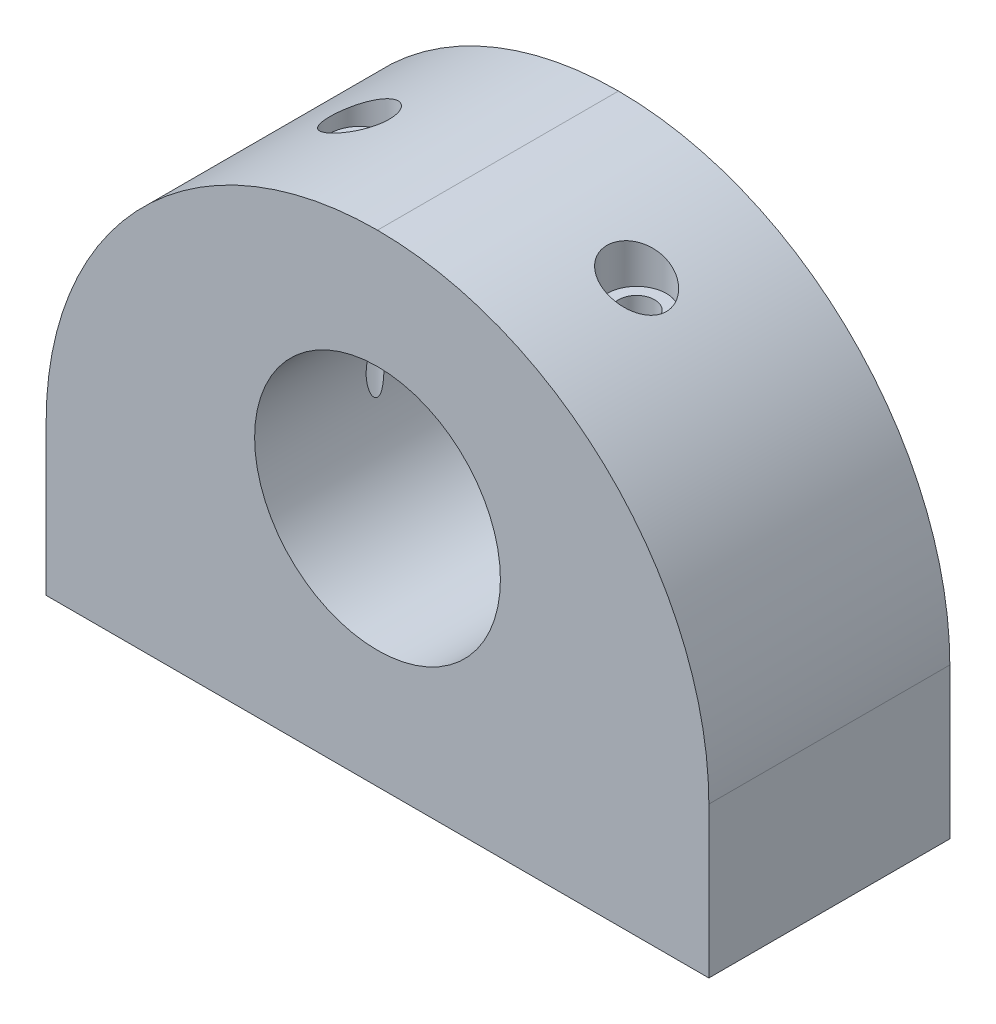
ISO-10303-21;
HEADER;
FILE_DESCRIPTION(('STEP AP214'),'2;1');
FILE_NAME('part.step','',(''),(''),'','','');
FILE_SCHEMA(('AUTOMOTIVE_DESIGN { 1 0 10303 214 1 1 1 1 }'));
ENDSEC;
DATA;
#1=APPLICATION_CONTEXT('core data for automotive mechanical design processes');
#2=APPLICATION_PROTOCOL_DEFINITION('international standard','automotive_design',2000,#1);
#3=PRODUCT_CONTEXT('',#1,'mechanical');
#4=PRODUCT('Part','Part','',(#3));
#5=PRODUCT_RELATED_PRODUCT_CATEGORY('part','',(#4));
#6=PRODUCT_DEFINITION_FORMATION('','',#4);
#7=PRODUCT_DEFINITION_CONTEXT('part definition',#1,'design');
#8=PRODUCT_DEFINITION('design','',#6,#7);
#9=PRODUCT_DEFINITION_SHAPE('','',#8);
#10=(LENGTH_UNIT() NAMED_UNIT(*) SI_UNIT(.MILLI.,.METRE.));
#11=(NAMED_UNIT(*) PLANE_ANGLE_UNIT() SI_UNIT($,.RADIAN.));
#12=(NAMED_UNIT(*) SI_UNIT($,.STERADIAN.) SOLID_ANGLE_UNIT());
#13=UNCERTAINTY_MEASURE_WITH_UNIT(LENGTH_MEASURE(1.E-05),#10,'distance_accuracy_value','');
#14=(GEOMETRIC_REPRESENTATION_CONTEXT(3) GLOBAL_UNCERTAINTY_ASSIGNED_CONTEXT((#13)) GLOBAL_UNIT_ASSIGNED_CONTEXT((#10,
#11,#12)) REPRESENTATION_CONTEXT('',''));
#15=CARTESIAN_POINT('',(0.,0.,0.));
#16=DIRECTION('',(0.,0.,1.));
#17=DIRECTION('',(1.,0.,0.));
#18=AXIS2_PLACEMENT_3D('',#15,#16,#17);
#19=CARTESIAN_POINT('',(0.,12.5,10.));
#20=DIRECTION('',(0.,0.,1.));
#21=DIRECTION('',(1.,0.,0.));
#22=AXIS2_PLACEMENT_3D('',#19,#20,#21);
#23=CYLINDRICAL_SURFACE('',#22,27.5);
#24=DIRECTION('',(0.,0.,-1.));
#25=VECTOR('',#24,1.);
#26=CARTESIAN_POINT('',(-27.5,12.5,-10.));
#27=LINE('',#26,#25);
#28=CARTESIAN_POINT('',(-27.5,12.5,10.));
#29=VERTEX_POINT('',#28);
#30=CARTESIAN_POINT('',(-27.5,12.5,-10.));
#31=VERTEX_POINT('',#30);
#32=EDGE_CURVE('E12',#29,#31,#27,.T.);
#33=ORIENTED_EDGE('',*,*,#32,.F.);
#34=CARTESIAN_POINT('',(0.,12.5,10.));
#35=DIRECTION('',(0.,0.,-1.));
#36=DIRECTION('',(-1.,0.,0.));
#37=AXIS2_PLACEMENT_3D('',#34,#35,#36);
#38=CIRCLE('',#37,27.5);
#39=CARTESIAN_POINT('',(0.,40.,10.));
#40=VERTEX_POINT('',#39);
#41=EDGE_CURVE('E90',#40,#29,#38,.F.);
#42=ORIENTED_EDGE('',*,*,#41,.F.);
#43=DIRECTION('',(0.,0.,-1.));
#44=VECTOR('',#43,1.);
#45=CARTESIAN_POINT('',(0.,40.,10.));
#46=LINE('',#45,#44);
#47=CARTESIAN_POINT('',(0.,40.,-10.));
#48=VERTEX_POINT('',#47);
#49=EDGE_CURVE('E141',#48,#40,#46,.F.);
#50=ORIENTED_EDGE('',*,*,#49,.F.);
#51=CARTESIAN_POINT('',(0.,12.5,-10.));
#52=DIRECTION('',(0.,0.,-1.));
#53=DIRECTION('',(-1.,0.,0.));
#54=AXIS2_PLACEMENT_3D('',#51,#52,#53);
#55=CIRCLE('',#54,27.5);
#56=EDGE_CURVE('E153',#31,#48,#55,.T.);
#57=ORIENTED_EDGE('',*,*,#56,.F.);
#58=EDGE_LOOP('',(#33,#42,#50,#57));
#59=FACE_BOUND('',#58,.T.);
#60=CARTESIAN_POINT('',(-11.4636628442395,37.4966884645467,-2.43388740714656));
#61=CARTESIAN_POINT('',(-11.3187502849007,37.5631445263369,-2.43388292746166));
#62=CARTESIAN_POINT('',(-11.17316637208,37.6283723018546,-2.42108412599054));
#63=CARTESIAN_POINT('',(-10.8846904437393,37.7546700116435,-2.36939334544817));
#64=CARTESIAN_POINT('',(-10.7418008597957,37.8157363090562,-2.33047885711886));
#65=CARTESIAN_POINT('',(-10.4628652074215,37.9322896340026,-2.2264448284835));
#66=CARTESIAN_POINT('',(-10.3268394170802,37.9877605639262,-2.16125223275013));
#67=CARTESIAN_POINT('',(-10.0670593459489,38.0914807503173,-2.00556820236093));
#68=CARTESIAN_POINT('',(-9.94329890143685,38.1397336403512,-1.91508956296168));
#69=CARTESIAN_POINT('',(-9.72040849568458,38.2250272940972,-1.71735432002899));
#70=CARTESIAN_POINT('',(-9.6202164219388,38.2625838138848,-1.61151883352352));
#71=CARTESIAN_POINT('',(-9.43913016097397,38.3294825129698,-1.38219586834433));
#72=CARTESIAN_POINT('',(-9.35822786411754,38.3588281451194,-1.25871584267422));
#73=CARTESIAN_POINT('',(-9.2241982598767,38.4069275520465,-1.00716879322838));
#74=CARTESIAN_POINT('',(-9.16950779606019,38.4262850073808,-0.880048498421058));
#75=CARTESIAN_POINT('',(-9.08202884804133,38.457059238826,-0.617579103269964));
#76=CARTESIAN_POINT('',(-9.04923380174365,38.4684783941019,-0.482232481650487));
#77=CARTESIAN_POINT('',(-9.00783569194936,38.482866557803,-0.213633650055177));
#78=CARTESIAN_POINT('',(-8.99822423227221,38.4861878651252,-0.0805547632115815));
#79=CARTESIAN_POINT('',(-9.0005960185081,38.485366562536,0.185378765012726));
#80=CARTESIAN_POINT('',(-9.01257648877072,38.4812249119907,0.318233433019376));
#81=CARTESIAN_POINT('',(-9.05733704534923,38.4656539679864,0.577943304712344));
#82=CARTESIAN_POINT('',(-9.08981317367476,38.4543311617179,0.704857552161629));
#83=CARTESIAN_POINT('',(-9.17408132843954,38.4246641798452,0.951218226379017));
#84=CARTESIAN_POINT('',(-9.22587362922108,38.4063199045169,1.07066454705407));
#85=CARTESIAN_POINT('',(-9.34772966522737,38.3626018618709,1.30049902811941));
#86=CARTESIAN_POINT('',(-9.41802560376285,38.3371384842706,1.41074677619876));
#87=CARTESIAN_POINT('',(-9.57410919294028,38.2797077568492,1.6177314500106));
#88=CARTESIAN_POINT('',(-9.65989899480498,38.2477395037899,1.71446649628001));
#89=CARTESIAN_POINT('',(-9.84785633347399,38.1764522289789,1.89591831838503));
#90=CARTESIAN_POINT('',(-9.95053837575958,38.1368920070729,1.98000648969695));
#91=CARTESIAN_POINT('',(-10.1663755991783,38.0520694214483,2.12983045385975));
#92=CARTESIAN_POINT('',(-10.2795334087527,38.0068056256299,2.19556162410659));
#93=CARTESIAN_POINT('',(-10.5204690601516,37.9084176101991,2.31133515906335));
#94=CARTESIAN_POINT('',(-10.6487188812109,37.854977585868,2.3601254560184));
#95=CARTESIAN_POINT('',(-10.9097486847534,37.7437622820573,2.43559952966823));
#96=CARTESIAN_POINT('',(-11.0425301819699,37.6859855451174,2.46227583780033));
#97=CARTESIAN_POINT('',(-11.3193211836281,37.5628723462289,2.4948153758474));
#98=CARTESIAN_POINT('',(-11.4634250093645,37.4972940119841,2.49896505170834));
#99=CARTESIAN_POINT('',(-11.7493036814876,37.3642064342504,2.48239173889646));
#100=CARTESIAN_POINT('',(-11.8910776632438,37.2966964983103,2.46165971862359));
#101=CARTESIAN_POINT('',(-12.1772143432655,37.1574984977397,2.39409289184429));
#102=CARTESIAN_POINT('',(-12.3212241685044,37.0858021861073,2.34577014522717));
#103=CARTESIAN_POINT('',(-12.598931527091,36.9446561038351,2.22300706106538));
#104=CARTESIAN_POINT('',(-12.7326258980716,36.8752070258794,2.14855875281559));
#105=CARTESIAN_POINT('',(-12.9858663442058,36.7412424213846,1.9745690047809));
#106=CARTESIAN_POINT('',(-13.1053887872863,36.6767351971755,1.87498649447732));
#107=CARTESIAN_POINT('',(-13.3255203462404,36.5561067506252,1.65249352076747));
#108=CARTESIAN_POINT('',(-13.4261392446099,36.4999811939118,1.52959518973868));
#109=CARTESIAN_POINT('',(-13.5957519082172,36.4042719347363,1.27483897594976));
#110=CARTESIAN_POINT('',(-13.666750258423,36.3636668186367,1.14472294323275));
#111=CARTESIAN_POINT('',(-13.755393969547,36.3126079347279,0.939616906211138));
#112=CARTESIAN_POINT('',(-13.7819663236981,36.2972297207655,0.869592529792016));
#113=CARTESIAN_POINT('',(-13.828782310287,36.270054833589,0.726795207073282));
#114=CARTESIAN_POINT('',(-13.8490270301533,36.258257544989,0.654022735456443));
#115=CARTESIAN_POINT('',(-13.8949916442726,36.231422090962,0.453089483054786));
#116=CARTESIAN_POINT('',(-13.9141367089608,36.220179035691,0.322820492593811));
#117=CARTESIAN_POINT('',(-13.9313329630078,36.2100836532432,0.0605224696961118));
#118=CARTESIAN_POINT('',(-13.9293957867765,36.2112244919107,-0.0715055518270032));
#119=CARTESIAN_POINT('',(-13.9056695241169,36.2251449443268,-0.321777287296414));
#120=CARTESIAN_POINT('',(-13.8855743050843,36.236931441135,-0.440241982742023));
#121=CARTESIAN_POINT('',(-13.8288590228901,36.2700173700091,-0.671731435753916));
#122=CARTESIAN_POINT('',(-13.7922379449076,36.2913173862809,-0.784755858771852));
#123=CARTESIAN_POINT('',(-13.7028767840055,36.3429000094931,-1.00564352557963));
#124=CARTESIAN_POINT('',(-13.6497365809356,36.3734049679851,-1.11329166082722));
#125=CARTESIAN_POINT('',(-13.5297074692939,36.4416326365473,-1.31808684204922));
#126=CARTESIAN_POINT('',(-13.46281418096,36.4793576456258,-1.41523052773618));
#127=CARTESIAN_POINT('',(-13.3095007104101,36.5648223428198,-1.60739759469621));
#128=CARTESIAN_POINT('',(-13.2217560258734,36.6132020547928,-1.70107755743184));
#129=CARTESIAN_POINT('',(-13.0344675746565,36.7149545648423,-1.87262582386961));
#130=CARTESIAN_POINT('',(-12.9349152640853,36.7683309725245,-1.95048256612987));
#131=CARTESIAN_POINT('',(-12.7131446098331,36.8853147538789,-2.09832984687759));
#132=CARTESIAN_POINT('',(-12.5896533267602,36.9493605933034,-2.16606596807872));
#133=CARTESIAN_POINT('',(-12.3339282432006,37.0793563158435,-2.27934293762099));
#134=CARTESIAN_POINT('',(-12.2016995614947,37.1453050716041,-2.32489665280735));
#135=CARTESIAN_POINT('',(-11.9683746295409,37.2592408680313,-2.38377935751793));
#136=CARTESIAN_POINT('',(-11.86860625623,37.307228593442,-2.40250560759982));
#137=CARTESIAN_POINT('',(-11.6672236970172,37.4025763590298,-2.42756157229922));
#138=CARTESIAN_POINT('',(-11.5656094030279,37.4499363621681,-2.43389055862261));
#139=CARTESIAN_POINT('',(-11.4636628442395,37.4966884645467,-2.43388740714656));
#140=B_SPLINE_CURVE_WITH_KNOTS('',3,(#60,#61,#62,#63,#64,#65,#66,#67,#68,#69,#70,#71,#72,#73,
#74,#75,#76,#77,#78,#79,#80,#81,#82,#83,#84,#85,#86,#87,#88,#89,#90,#91,#92,#93,#94,#95,#96,#97,
#98,#99,#100,#101,#102,#103,#104,#105,#106,#107,#108,#109,#110,#111,#112,#113,#114,#115,#116,
#117,#118,#119,#120,#121,#122,#123,#124,#125,#126,#127,#128,#129,#130,#131,#132,#133,#134,#135,
#136,#137,#138,#139),.UNSPECIFIED.,.T.,.F.,(4,2,2,2,2,2,2,2,2,2,2,2,2,2,2,2,2,2,2,2,2,2,2,2,2,2,
2,2,2,2,2,2,2,2,2,2,2,2,2,4),(0.,0.477893257210122,0.956198943228954,1.43584363432737,
1.91524605347493,2.36436117797892,2.81328715523456,3.23036802712489,3.64732384296207,
4.0457879219178,4.44420078182535,4.83683958183017,5.22948395858852,5.62731227863222,
6.02519587709018,6.43885557554874,6.85261934679835,7.29249830949078,7.73252577215443,
8.20559995740199,8.67884591186331,9.18041465334582,9.68213655277133,10.1846836590558,
10.6869699788627,11.1450274437512,11.3740584123676,11.6030499994571,11.9971290226849,
12.3909905811594,12.7515210856969,13.1120737327268,13.4821475583303,13.8523394194736,
14.2622120119965,14.6723830150313,15.134640660577,15.5966298544698,15.9328099027657,
16.2690096998233),.UNSPECIFIED.);
#141=CARTESIAN_POINT('',(-11.4636628442395,37.4966884645467,-2.43388740714656));
#142=VERTEX_POINT('',#141);
#143=EDGE_CURVE('E73',#142,#142,#140,.T.);
#144=ORIENTED_EDGE('',*,*,#143,.T.);
#145=EDGE_LOOP('',(#144));
#146=FACE_BOUND('',#145,.T.);
#147=ADVANCED_FACE('F69',(#59,#146),#23,.T.);
#148=CARTESIAN_POINT('',(0.,12.5,0.));
#149=DIRECTION('',(0.,0.,-1.));
#150=DIRECTION('',(-1.,0.,0.));
#151=AXIS2_PLACEMENT_3D('',#148,#149,#150);
#152=CYLINDRICAL_SURFACE('',#151,27.5);
#153=CARTESIAN_POINT('',(0.,12.5,10.));
#154=DIRECTION('',(0.,0.,-1.));
#155=DIRECTION('',(-1.,0.,0.));
#156=AXIS2_PLACEMENT_3D('',#153,#154,#155);
#157=CIRCLE('',#156,27.5);
#158=CARTESIAN_POINT('',(27.5,12.5,10.));
#159=VERTEX_POINT('',#158);
#160=EDGE_CURVE('E82',#159,#40,#157,.F.);
#161=ORIENTED_EDGE('',*,*,#160,.F.);
#162=DIRECTION('',(0.,0.,-1.));
#163=VECTOR('',#162,1.);
#164=CARTESIAN_POINT('',(27.5,12.5,10.));
#165=LINE('',#164,#163);
#166=CARTESIAN_POINT('',(27.5,12.5,-10.));
#167=VERTEX_POINT('',#166);
#168=EDGE_CURVE('E160',#167,#159,#165,.F.);
#169=ORIENTED_EDGE('',*,*,#168,.F.);
#170=CARTESIAN_POINT('',(0.,12.5,-10.));
#171=DIRECTION('',(0.,0.,-1.));
#172=DIRECTION('',(-1.,0.,0.));
#173=AXIS2_PLACEMENT_3D('',#170,#171,#172);
#174=CIRCLE('',#173,27.5);
#175=EDGE_CURVE('E158',#48,#167,#174,.T.);
#176=ORIENTED_EDGE('',*,*,#175,.F.);
#177=ORIENTED_EDGE('',*,*,#49,.T.);
#178=EDGE_LOOP('',(#161,#169,#176,#177));
#179=FACE_BOUND('',#178,.T.);
#180=CARTESIAN_POINT('',(11.5363371557605,37.4632314620647,-2.4360841246819));
#181=CARTESIAN_POINT('',(11.6897433726353,37.3923347267846,-2.43607902730868));
#182=CARTESIAN_POINT('',(11.8426296421748,37.3199486584,-2.42174371684128));
#183=CARTESIAN_POINT('',(12.1430116175024,37.1743844893178,-2.36520718517411));
#184=CARTESIAN_POINT('',(12.2904968442241,37.1012051725748,-2.32295453922795));
#185=CARTESIAN_POINT('',(12.5759060812687,36.9565363729112,-2.21154725469069));
#186=CARTESIAN_POINT('',(12.7138288929735,36.88504710257,-2.14238925075607));
#187=CARTESIAN_POINT('',(12.9759670752474,36.7465720677406,-1.97832238174008));
#188=CARTESIAN_POINT('',(13.1001868042679,36.6795848739702,-1.88342173786636));
#189=CARTESIAN_POINT('',(13.3270409855903,36.5552743613435,-1.67261414241162));
#190=CARTESIAN_POINT('',(13.4302132740268,36.4977205860578,-1.55742671926553));
#191=CARTESIAN_POINT('',(13.6148926492006,36.3934293851152,-1.30657574187727));
#192=CARTESIAN_POINT('',(13.6964203550865,36.3466816708761,-1.17093186954491));
#193=CARTESIAN_POINT('',(13.8249315889303,36.2723823534441,-0.900056341512269));
#194=CARTESIAN_POINT('',(13.8748700307092,36.2432091160916,-0.766693688650086));
#195=CARTESIAN_POINT('',(13.9321581287729,36.2096065230187,-0.560314684845361));
#196=CARTESIAN_POINT('',(13.9483180058318,36.200098271567,-0.490461488797693));
#197=CARTESIAN_POINT('',(13.9745411335176,36.1846454492442,-0.349238379335035));
#198=CARTESIAN_POINT('',(13.9846051822937,36.1787004118295,-0.277868665750409));
#199=CARTESIAN_POINT('',(14.0035080972494,36.1675306173733,-0.081503287251604));
#200=CARTESIAN_POINT('',(14.0060227080411,36.1660391859402,0.0443936777576234));
#201=CARTESIAN_POINT('',(13.9919008692107,36.174390422627,0.294632582818073));
#202=CARTESIAN_POINT('',(13.9752690399399,36.1842303563022,0.418974890715409));
#203=CARTESIAN_POINT('',(13.924911010719,36.213870413569,0.657154176422131));
#204=CARTESIAN_POINT('',(13.8919575755661,36.2332199979547,0.771212886388198));
#205=CARTESIAN_POINT('',(13.8108469813195,36.2805108563567,0.991863031813362));
#206=CARTESIAN_POINT('',(13.7626869864523,36.3084537328554,1.09845306995398));
#207=CARTESIAN_POINT('',(13.649397388221,36.3735936739583,1.3087460017926));
#208=CARTESIAN_POINT('',(13.5833696318309,36.4112734694948,1.41181306712599));
#209=CARTESIAN_POINT('',(13.4383707290971,36.4930639945168,1.60551244505964));
#210=CARTESIAN_POINT('',(13.3593938513319,36.5371775707037,1.69613921867113));
#211=CARTESIAN_POINT('',(13.1801738137447,36.6359631224589,1.87424361435776));
#212=CARTESIAN_POINT('',(13.0785081275035,36.6912660814918,1.95993945256468));
#213=CARTESIAN_POINT('',(12.8643184998488,36.8058446221563,2.11317381550108));
#214=CARTESIAN_POINT('',(12.7517889818945,36.8651222392096,2.18070294696669));
#215=CARTESIAN_POINT('',(12.5046122021861,36.9929828218023,2.30368239328101));
#216=CARTESIAN_POINT('',(12.3689224469686,37.0618378687411,2.35676373809518));
#217=CARTESIAN_POINT('',(12.0905529761738,37.2000547262615,2.43831517730562));
#218=CARTESIAN_POINT('',(11.9478705724763,37.2694167228674,2.46677572728223));
#219=CARTESIAN_POINT('',(11.6509477270446,37.4105173503326,2.49911282120013));
#220=CARTESIAN_POINT('',(11.4965058607596,37.4821735509847,2.50153374238884));
#221=CARTESIAN_POINT('',(11.188190918811,37.6217637396061,2.4772062658126));
#222=CARTESIAN_POINT('',(11.0343178197578,37.6896978822626,2.45045908122965));
#223=CARTESIAN_POINT('',(10.7358729781339,37.8183094854816,2.368509881174));
#224=CARTESIAN_POINT('',(10.5911656451032,37.8791241128072,2.31402224343336));
#225=CARTESIAN_POINT('',(10.3123172761061,37.9937016567376,2.1774827042363));
#226=CARTESIAN_POINT('',(10.1781713405997,38.0474678509741,2.09544367827467));
#227=CARTESIAN_POINT('',(9.93534662555918,38.1428289482943,1.9125000729195));
#228=CARTESIAN_POINT('',(9.82551826996986,38.1850297954634,1.8134385279726));
#229=CARTESIAN_POINT('',(9.62415057394914,38.2611593917952,1.59550960882426));
#230=CARTESIAN_POINT('',(9.53260201128487,38.2950923140741,1.47665227747727));
#231=CARTESIAN_POINT('',(9.37802360344685,38.3516721186194,1.23246207804994));
#232=CARTESIAN_POINT('',(9.31334449884184,38.3749852029933,1.10832586625304));
#233=CARTESIAN_POINT('',(9.205651645067,38.4134959667127,0.849818000438824));
#234=CARTESIAN_POINT('',(9.16263047958427,38.4286964241667,0.715449868300695));
#235=CARTESIAN_POINT('',(9.10168849445629,38.4501495048778,0.447833234781073));
#236=CARTESIAN_POINT('',(9.08258310610217,38.4568247705048,0.314887158750433));
#237=CARTESIAN_POINT('',(9.06621669937715,38.4625460429938,0.0475018599476124));
#238=CARTESIAN_POINT('',(9.06895208892154,38.4615933044097,-0.0869371136604769));
#239=CARTESIAN_POINT('',(9.09586396700819,38.452176142863,-0.350489182534569));
#240=CARTESIAN_POINT('',(9.11958599671794,38.4438709327215,-0.479654786617618));
#241=CARTESIAN_POINT('',(9.1869560503783,38.4200907199793,-0.731976862009573));
#242=CARTESIAN_POINT('',(9.23060388957384,38.4046157838573,-0.855133389023819));
#243=CARTESIAN_POINT('',(9.3366355198518,38.3665887666516,-1.09303913486361));
#244=CARTESIAN_POINT('',(9.39915805094348,38.3439842216968,-1.20771798797645));
#245=CARTESIAN_POINT('',(9.5406027579424,38.2921025832769,-1.4247637752128));
#246=CARTESIAN_POINT('',(9.6195260534816,38.2628250342521,-1.52712986802673));
#247=CARTESIAN_POINT('',(9.7941272658697,38.1969658055244,-1.72056985017049));
#248=CARTESIAN_POINT('',(9.89028973340602,38.1601667684473,-1.81113157883547));
#249=CARTESIAN_POINT('',(10.0942641497554,38.0806139251031,-1.97488034113079));
#250=CARTESIAN_POINT('',(10.2020817329176,38.0378572358588,-2.04805891619845));
#251=CARTESIAN_POINT('',(10.4328918758438,37.9444722024133,-2.17973221239795));
#252=CARTESIAN_POINT('',(10.5564067990554,37.8935254730073,-2.23708237390228));
#253=CARTESIAN_POINT('',(10.8092255724765,37.7869417054756,-2.33032035037494));
#254=CARTESIAN_POINT('',(10.9385244996709,37.7313086217827,-2.36622605761926));
#255=CARTESIAN_POINT('',(11.146446027684,37.6398873351617,-2.40635240938082));
#256=CARTESIAN_POINT('',(11.2242980776031,37.6052273770113,-2.41752011303415));
#257=CARTESIAN_POINT('',(11.3802572501421,37.5349170028628,-2.43238716611022));
#258=CARTESIAN_POINT('',(11.4583643658743,37.499266613418,-2.43608671555742));
#259=CARTESIAN_POINT('',(11.5363371557605,37.4632314620647,-2.4360841246819));
#260=B_SPLINE_CURVE_WITH_KNOTS('',3,(#180,#181,#182,#183,#184,#185,#186,#187,#188,#189,#190,
#191,#192,#193,#194,#195,#196,#197,#198,#199,#200,#201,#202,#203,#204,#205,#206,#207,#208,#209,
#210,#211,#212,#213,#214,#215,#216,#217,#218,#219,#220,#221,#222,#223,#224,#225,#226,#227,#228,
#229,#230,#231,#232,#233,#234,#235,#236,#237,#238,#239,#240,#241,#242,#243,#244,#245,#246,#247,
#248,#249,#250,#251,#252,#253,#254,#255,#256,#257,#258,#259),.UNSPECIFIED.,.T.,.F.,(4,2,2,2,2,2,
2,2,2,2,2,2,2,2,2,2,2,2,2,2,2,2,2,2,2,2,2,2,2,2,2,2,2,2,2,2,2,2,2,4),(0.,0.506674403498618,
1.01428473140633,1.5219585720406,2.02947047169935,2.52168237930933,3.01342369774274,
3.44669095916901,3.66335044857819,3.87998156383186,4.25565924316658,4.63124628429187,
4.99054212604221,5.34990501017591,5.73257967783214,6.11542418095317,6.54570869985377,
6.97621527558866,7.45757376708343,7.93911877698059,8.44745105507155,8.95576219102683,
9.45159956437058,9.9472055414543,10.4061728413297,10.8649080019381,11.2884441045367,
11.7118350771464,12.1132983576054,12.5146956120094,12.9076078581113,13.3005164611463,
13.6963865600967,14.092283692818,14.5018551991767,14.9116255947639,15.3459837075104,
15.7799789034961,16.0375165430314,16.2950472846766),.UNSPECIFIED.);
#261=CARTESIAN_POINT('',(11.5363371557605,37.4632314620647,-2.4360841246819));
#262=VERTEX_POINT('',#261);
#263=EDGE_CURVE('E203',#262,#262,#260,.T.);
#264=ORIENTED_EDGE('',*,*,#263,.T.);
#265=EDGE_LOOP('',(#264));
#266=FACE_BOUND('',#265,.T.);
#267=ADVANCED_FACE('F211',(#179,#266),#152,.T.);
#268=CARTESIAN_POINT('',(-27.5,40.,10.));
#269=DIRECTION('',(-1.,0.,0.));
#270=DIRECTION('',(0.,0.,1.));
#271=AXIS2_PLACEMENT_3D('',#268,#269,#270);
#272=PLANE('',#271);
#273=DIRECTION('',(0.,-1.,0.));
#274=VECTOR('',#273,1.);
#275=CARTESIAN_POINT('',(-27.5,40.,10.));
#276=LINE('',#275,#274);
#277=CARTESIAN_POINT('',(-27.5,0.,10.));
#278=VERTEX_POINT('',#277);
#279=EDGE_CURVE('E151',#29,#278,#276,.T.);
#280=ORIENTED_EDGE('',*,*,#279,.F.);
#281=ORIENTED_EDGE('',*,*,#32,.T.);
#282=DIRECTION('',(0.,-1.,0.));
#283=VECTOR('',#282,1.);
#284=CARTESIAN_POINT('',(-27.5,40.,-10.));
#285=LINE('',#284,#283);
#286=CARTESIAN_POINT('',(-27.5,0.,-10.));
#287=VERTEX_POINT('',#286);
#288=EDGE_CURVE('E118',#31,#287,#285,.T.);
#289=ORIENTED_EDGE('',*,*,#288,.T.);
#290=DIRECTION('',(0.,0.,-1.));
#291=VECTOR('',#290,1.);
#292=CARTESIAN_POINT('',(-27.5,0.,10.));
#293=LINE('',#292,#291);
#294=EDGE_CURVE('E122',#278,#287,#293,.T.);
#295=ORIENTED_EDGE('',*,*,#294,.F.);
#296=EDGE_LOOP('',(#280,#281,#289,#295));
#297=FACE_BOUND('',#296,.T.);
#298=ADVANCED_FACE('F120',(#297),#272,.T.);
#299=CARTESIAN_POINT('',(-27.5,40.,10.));
#300=DIRECTION('',(0.,0.,-1.));
#301=DIRECTION('',(-1.,0.,0.));
#302=AXIS2_PLACEMENT_3D('',#299,#300,#301);
#303=PLANE('',#302);
#304=CARTESIAN_POINT('',(0.,20.,10.));
#305=DIRECTION('',(0.,0.,-1.));
#306=DIRECTION('',(-1.,0.,0.));
#307=AXIS2_PLACEMENT_3D('',#304,#305,#306);
#308=CIRCLE('',#307,10.2);
#309=CARTESIAN_POINT('',(-10.2,20.,10.));
#310=VERTEX_POINT('',#309);
#311=EDGE_CURVE('E144',#310,#310,#308,.T.);
#312=ORIENTED_EDGE('',*,*,#311,.T.);
#313=EDGE_LOOP('',(#312));
#314=FACE_BOUND('',#313,.T.);
#315=DIRECTION('',(0.,-1.,0.));
#316=VECTOR('',#315,1.);
#317=CARTESIAN_POINT('',(27.5,40.,10.));
#318=LINE('',#317,#316);
#319=CARTESIAN_POINT('',(27.5,0.,10.));
#320=VERTEX_POINT('',#319);
#321=EDGE_CURVE('E154',#159,#320,#318,.T.);
#322=ORIENTED_EDGE('',*,*,#321,.F.);
#323=ORIENTED_EDGE('',*,*,#160,.T.);
#324=ORIENTED_EDGE('',*,*,#41,.T.);
#325=ORIENTED_EDGE('',*,*,#279,.T.);
#326=DIRECTION('',(1.,0.,0.));
#327=VECTOR('',#326,1.);
#328=CARTESIAN_POINT('',(-27.5,0.,10.));
#329=LINE('',#328,#327);
#330=EDGE_CURVE('E127',#278,#320,#329,.T.);
#331=ORIENTED_EDGE('',*,*,#330,.T.);
#332=EDGE_LOOP('',(#322,#323,#324,#325,#331));
#333=FACE_BOUND('',#332,.T.);
#334=ADVANCED_FACE('F218',(#314,#333),#303,.F.);
#335=CARTESIAN_POINT('',(27.5,40.,10.));
#336=DIRECTION('',(-1.,0.,0.));
#337=DIRECTION('',(0.,0.,1.));
#338=AXIS2_PLACEMENT_3D('',#335,#336,#337);
#339=PLANE('',#338);
#340=DIRECTION('',(0.,-1.,0.));
#341=VECTOR('',#340,1.);
#342=CARTESIAN_POINT('',(27.5,40.,-10.));
#343=LINE('',#342,#341);
#344=CARTESIAN_POINT('',(27.5,0.,-10.));
#345=VERTEX_POINT('',#344);
#346=EDGE_CURVE('E126',#167,#345,#343,.T.);
#347=ORIENTED_EDGE('',*,*,#346,.F.);
#348=ORIENTED_EDGE('',*,*,#168,.T.);
#349=ORIENTED_EDGE('',*,*,#321,.T.);
#350=DIRECTION('',(0.,0.,-1.));
#351=VECTOR('',#350,1.);
#352=CARTESIAN_POINT('',(27.5,0.,10.));
#353=LINE('',#352,#351);
#354=EDGE_CURVE('E136',#320,#345,#353,.T.);
#355=ORIENTED_EDGE('',*,*,#354,.T.);
#356=EDGE_LOOP('',(#347,#348,#349,#355));
#357=FACE_BOUND('',#356,.T.);
#358=ADVANCED_FACE('F221',(#357),#339,.F.);
#359=CARTESIAN_POINT('',(-27.5,40.,-10.));
#360=DIRECTION('',(0.,0.,-1.));
#361=DIRECTION('',(-1.,0.,0.));
#362=AXIS2_PLACEMENT_3D('',#359,#360,#361);
#363=PLANE('',#362);
#364=CARTESIAN_POINT('',(0.,20.,-10.));
#365=DIRECTION('',(0.,0.,-1.));
#366=DIRECTION('',(-1.,0.,0.));
#367=AXIS2_PLACEMENT_3D('',#364,#365,#366);
#368=CIRCLE('',#367,10.2);
#369=CARTESIAN_POINT('',(-10.2,20.,-10.));
#370=VERTEX_POINT('',#369);
#371=EDGE_CURVE('E258',#370,#370,#368,.T.);
#372=ORIENTED_EDGE('',*,*,#371,.F.);
#373=EDGE_LOOP('',(#372));
#374=FACE_BOUND('',#373,.T.);
#375=ORIENTED_EDGE('',*,*,#56,.T.);
#376=ORIENTED_EDGE('',*,*,#175,.T.);
#377=ORIENTED_EDGE('',*,*,#346,.T.);
#378=DIRECTION('',(1.,0.,0.));
#379=VECTOR('',#378,1.);
#380=CARTESIAN_POINT('',(-27.5,0.,-10.));
#381=LINE('',#380,#379);
#382=EDGE_CURVE('E130',#287,#345,#381,.T.);
#383=ORIENTED_EDGE('',*,*,#382,.F.);
#384=ORIENTED_EDGE('',*,*,#288,.F.);
#385=EDGE_LOOP('',(#375,#376,#377,#383,#384));
#386=FACE_BOUND('',#385,.T.);
#387=ADVANCED_FACE('F131',(#374,#386),#363,.T.);
#388=CARTESIAN_POINT('',(0.,0.,0.));
#389=DIRECTION('',(0.,-1.,0.));
#390=DIRECTION('',(0.,0.,-1.));
#391=AXIS2_PLACEMENT_3D('',#388,#389,#390);
#392=PLANE('',#391);
#393=CARTESIAN_POINT('',(-11.5,0.,0.));
#394=DIRECTION('',(0.,-1.,0.));
#395=DIRECTION('',(0.,0.,-1.));
#396=AXIS2_PLACEMENT_3D('',#393,#394,#395);
#397=CIRCLE('',#396,1.5);
#398=CARTESIAN_POINT('',(-11.5,0.,-1.5));
#399=VERTEX_POINT('',#398);
#400=EDGE_CURVE('E174',#399,#399,#397,.T.);
#401=ORIENTED_EDGE('',*,*,#400,.F.);
#402=EDGE_LOOP('',(#401));
#403=FACE_BOUND('',#402,.T.);
#404=CARTESIAN_POINT('',(11.5,0.,0.));
#405=DIRECTION('',(0.,-1.,0.));
#406=DIRECTION('',(0.,0.,-1.));
#407=AXIS2_PLACEMENT_3D('',#404,#405,#406);
#408=CIRCLE('',#407,1.5);
#409=CARTESIAN_POINT('',(11.5,0.,-1.5));
#410=VERTEX_POINT('',#409);
#411=EDGE_CURVE('E208',#410,#410,#408,.T.);
#412=ORIENTED_EDGE('',*,*,#411,.F.);
#413=EDGE_LOOP('',(#412));
#414=FACE_BOUND('',#413,.T.);
#415=ORIENTED_EDGE('',*,*,#294,.T.);
#416=ORIENTED_EDGE('',*,*,#382,.T.);
#417=ORIENTED_EDGE('',*,*,#354,.F.);
#418=ORIENTED_EDGE('',*,*,#330,.F.);
#419=EDGE_LOOP('',(#415,#416,#417,#418));
#420=FACE_BOUND('',#419,.T.);
#421=ADVANCED_FACE('F139',(#403,#414,#420),#392,.T.);
#422=CARTESIAN_POINT('',(0.,20.,30.));
#423=DIRECTION('',(0.,0.,-1.));
#424=DIRECTION('',(-1.,0.,0.));
#425=AXIS2_PLACEMENT_3D('',#422,#423,#424);
#426=CYLINDRICAL_SURFACE('',#425,10.2);
#427=CARTESIAN_POINT('',(-10.2,20.,0.748331477354775));
#428=CARTESIAN_POINT('',(-10.200000033578,20.1040716357945,0.748331529287817));
#429=CARTESIAN_POINT('',(-10.1984057735358,20.2081431549831,0.745581778757176));
#430=CARTESIAN_POINT('',(-10.1920486500515,20.415850758752,0.734374937911969));
#431=CARTESIAN_POINT('',(-10.1872870349179,20.5194869986968,0.725920096052078));
#432=CARTESIAN_POINT('',(-10.1746454028929,20.7261885321628,0.702575455627148));
#433=CARTESIAN_POINT('',(-10.1667554454135,20.8292509332379,0.687665130161449));
#434=CARTESIAN_POINT('',(-10.1480107397118,21.033616465135,0.65006403261683));
#435=CARTESIAN_POINT('',(-10.1371600079793,21.1349217829635,0.627383790379512));
#436=CARTESIAN_POINT('',(-10.1188713261968,21.2849220313376,0.585414817256849));
#437=CARTESIAN_POINT('',(-10.1124047219166,21.3348239359282,0.570009643268501));
#438=CARTESIAN_POINT('',(-10.0988996357905,21.4334203039372,0.535963512346618));
#439=CARTESIAN_POINT('',(-10.0918615267922,21.4821155279482,0.517324656175845));
#440=CARTESIAN_POINT('',(-10.0774215033093,21.5772998076234,0.476174945171415));
#441=CARTESIAN_POINT('',(-10.070023244787,21.6238042537254,0.453698825952256));
#442=CARTESIAN_POINT('',(-10.0550812676854,21.7138848406354,0.403608520466431));
#443=CARTESIAN_POINT('',(-10.0475380714235,21.7574696163366,0.376010486308421));
#444=CARTESIAN_POINT('',(-10.0359671992224,21.8220717526713,0.32701852013327));
#445=CARTESIAN_POINT('',(-10.0318054802542,21.8448199428797,0.307958210442761));
#446=CARTESIAN_POINT('',(-10.0238132699168,21.8877604733415,0.26703662489601));
#447=CARTESIAN_POINT('',(-10.0199824891882,21.9079550536848,0.245177838293246));
#448=CARTESIAN_POINT('',(-10.0139254700686,21.9394539113469,0.204644838593018));
#449=CARTESIAN_POINT('',(-10.0115461422631,21.9516825828251,0.186720342739599));
#450=CARTESIAN_POINT('',(-10.0073144362501,21.97326596963,0.149148315680832));
#451=CARTESIAN_POINT('',(-10.0054611770758,21.9826254918284,0.129503738036655));
#452=CARTESIAN_POINT('',(-10.0027864807963,21.9960712371776,0.0928355018269916));
#453=CARTESIAN_POINT('',(-10.0018327861565,22.0008378629082,0.0760738662903684));
#454=CARTESIAN_POINT('',(-10.0004905966856,22.007535784442,0.0419723156667098));
#455=CARTESIAN_POINT('',(-10.0001015496127,22.0094698505882,0.0246329825908599));
#456=CARTESIAN_POINT('',(-9.99993335301984,22.0103067469251,-0.0101617887157149));
#457=CARTESIAN_POINT('',(-10.0001555394819,22.0092029371846,-0.0276173979530322));
#458=CARTESIAN_POINT('',(-10.0011855620769,22.0040693124633,-0.062075480416783));
#459=CARTESIAN_POINT('',(-10.0019938725141,22.000037127774,-0.0790775750897797));
#460=CARTESIAN_POINT('',(-10.0043648747805,21.9881468017007,-0.116186078607695));
#461=CARTESIAN_POINT('',(-10.0060617723583,21.9796041658606,-0.136062147380967));
#462=CARTESIAN_POINT('',(-10.0100198305993,21.9594918300134,-0.17414908282634));
#463=CARTESIAN_POINT('',(-10.0122820984676,21.9479161880731,-0.19235658505755));
#464=CARTESIAN_POINT('',(-10.0186333762207,21.9150463534981,-0.237348885950692));
#465=CARTESIAN_POINT('',(-10.023011455644,21.8920533701641,-0.262837716080189));
#466=CARTESIAN_POINT('',(-10.0322121124295,21.8426497863544,-0.310129795808053));
#467=CARTESIAN_POINT('',(-10.0370358952209,21.8162298347242,-0.331922570068137));
#468=CARTESIAN_POINT('',(-10.0468642778976,21.7610531938795,-0.372606918572859));
#469=CARTESIAN_POINT('',(-10.0518698010707,21.7322832370137,-0.391479989873293));
#470=CARTESIAN_POINT('',(-10.0618667411512,21.6732420267328,-0.426739574511369));
#471=CARTESIAN_POINT('',(-10.0668581382383,21.6429692586458,-0.443123508671068));
#472=CARTESIAN_POINT('',(-10.0816560303385,21.5505143463538,-0.489240380024716));
#473=CARTESIAN_POINT('',(-10.091272808232,21.4867699656367,-0.515887980790714));
#474=CARTESIAN_POINT('',(-10.1111751030813,21.3454099681251,-0.567495586675553));
#475=CARTESIAN_POINT('',(-10.1212700002151,21.2673609286024,-0.591290828602516));
#476=CARTESIAN_POINT('',(-10.1398017225976,21.1093958254297,-0.632748336438049));
#477=CARTESIAN_POINT('',(-10.1482364901068,21.0294775803966,-0.650403011607882));
#478=CARTESIAN_POINT('',(-10.163298069018,20.8683011040402,-0.680819571621281));
#479=CARTESIAN_POINT('',(-10.1699190348639,20.7870394148321,-0.693565689394217));
#480=CARTESIAN_POINT('',(-10.1812346874308,20.6238263389757,-0.714842421255575));
#481=CARTESIAN_POINT('',(-10.1859288629955,20.5418747751878,-0.723371916842709));
#482=CARTESIAN_POINT('',(-10.1958190892783,20.3226245425636,-0.74113930268245));
#483=CARTESIAN_POINT('',(-10.1992513878496,20.1849636121065,-0.747036275692808));
#484=CARTESIAN_POINT('',(-10.2005303668043,19.90939974076,-0.749247472574265));
#485=CARTESIAN_POINT('',(-10.1983700783692,19.7714967121152,-0.745549740649254));
#486=CARTESIAN_POINT('',(-10.1885046223143,19.4968337990577,-0.7280771066227));
#487=CARTESIAN_POINT('',(-10.1808143217779,19.3600718421267,-0.714329222070358));
#488=CARTESIAN_POINT('',(-10.1653059104553,19.1566848044206,-0.684622155052405));
#489=CARTESIAN_POINT('',(-10.159480107829,19.0892314790509,-0.673217488147566));
#490=CARTESIAN_POINT('',(-10.1465672189303,18.9551504694444,-0.646865463760855));
#491=CARTESIAN_POINT('',(-10.1394803260601,18.888522660279,-0.631918649390153));
#492=CARTESIAN_POINT('',(-10.121867305122,18.7369959347173,-0.592753794819423));
#493=CARTESIAN_POINT('',(-10.1109428335731,18.652490917999,-0.567101807203621));
#494=CARTESIAN_POINT('',(-10.093426118222,18.5287828714162,-0.521351877597464));
#495=CARTESIAN_POINT('',(-10.0874141982619,18.4881463116136,-0.504936574630592));
#496=CARTESIAN_POINT('',(-10.0751190467947,18.4082665469083,-0.469118057410322));
#497=CARTESIAN_POINT('',(-10.0688358162009,18.3690233373163,-0.449714853213992));
#498=CARTESIAN_POINT('',(-10.0535163123479,18.276699954607,-0.398366691597849));
#499=CARTESIAN_POINT('',(-10.0444124499876,18.2245811964173,-0.364548285342798));
#500=CARTESIAN_POINT('',(-10.0313233001139,18.1525221727135,-0.305596050559543));
#501=CARTESIAN_POINT('',(-10.0270333292956,18.1294156623973,-0.284439120259161));
#502=CARTESIAN_POINT('',(-10.0189519195174,18.0866081945628,-0.238816881857116));
#503=CARTESIAN_POINT('',(-10.015159063258,18.0668975025249,-0.21436140130698));
#504=CARTESIAN_POINT('',(-10.0098224090723,18.0394975621931,-0.172128553119001));
#505=CARTESIAN_POINT('',(-10.0079797232397,18.0301243409818,-0.155489868841681));
#506=CARTESIAN_POINT('',(-10.0047837932518,18.0139564948206,-0.120948538080458));
#507=CARTESIAN_POINT('',(-10.0034300825643,18.0071594116656,-0.103047115977787));
#508=CARTESIAN_POINT('',(-10.0013416176499,17.9967037978881,-0.0660902358877472));
#509=CARTESIAN_POINT('',(-10.0006133680375,17.9930782432211,-0.0470248078042544));
#510=CARTESIAN_POINT('',(-9.99990124378878,17.9895326401602,-0.00853964277915052));
#511=CARTESIAN_POINT('',(-9.9999168058048,17.9896097874161,0.0108798148844167));
#512=CARTESIAN_POINT('',(-10.0006414611614,17.9932184058135,0.0470350659525692));
#513=CARTESIAN_POINT('',(-10.0012680666583,17.9963390286345,0.0638159441229373));
#514=CARTESIAN_POINT('',(-10.0030271082752,18.0051394252874,0.0966602278129358));
#515=CARTESIAN_POINT('',(-10.0041598846001,18.0108209203422,0.112723142777968));
#516=CARTESIAN_POINT('',(-10.0074027758294,18.0271887292072,0.150500510858899));
#517=CARTESIAN_POINT('',(-10.0097236498934,18.0389758466914,0.171716603975364));
#518=CARTESIAN_POINT('',(-10.0149174172518,18.0656743436144,0.212001039349955));
#519=CARTESIAN_POINT('',(-10.0177917117669,18.0805936624169,0.231063730697998));
#520=CARTESIAN_POINT('',(-10.0260345028133,18.1239937826696,0.280024480125234));
#521=CARTESIAN_POINT('',(-10.0317230683245,18.154573364371,0.307986906690305));
#522=CARTESIAN_POINT('',(-10.0434192193592,18.2193182251437,0.35925169148515));
#523=CARTESIAN_POINT('',(-10.0494276521308,18.2534932876664,0.382540805935212));
#524=CARTESIAN_POINT('',(-10.0618622905843,18.3265618068741,0.427000181271683));
#525=CARTESIAN_POINT('',(-10.068287635073,18.3656179113771,0.447899694981985));
#526=CARTESIAN_POINT('',(-10.0809111798682,18.4453717194392,0.486408923252904));
#527=CARTESIAN_POINT('',(-10.0871091173837,18.4860712147176,0.50401492246943));
#528=CARTESIAN_POINT('',(-10.1051823854682,18.6099510567899,0.552912491216022));
#529=CARTESIAN_POINT('',(-10.1165142544808,18.6947799525445,0.580210230113172));
#530=CARTESIAN_POINT('',(-10.1387176575801,18.8791639149873,0.630680923950211));
#531=CARTESIAN_POINT('',(-10.1492809320013,18.9790621195538,0.652671384445374));
#532=CARTESIAN_POINT('',(-10.1675347124589,19.1805569167215,0.689163814303281));
#533=CARTESIAN_POINT('',(-10.1752219248834,19.2821553181586,0.703657205383308));
#534=CARTESIAN_POINT('',(-10.1875669165433,19.4862479113523,0.726418772648655));
#535=CARTESIAN_POINT('',(-10.1922235374344,19.5887424304695,0.734684568729824));
#536=CARTESIAN_POINT('',(-10.1984406989076,19.794157899148,0.745642041061807));
#537=CARTESIAN_POINT('',(-10.1999999667933,19.8970790065948,0.748331425995919));
#538=CARTESIAN_POINT('',(-10.2,20.,0.748331477354775));
#539=B_SPLINE_CURVE_WITH_KNOTS('',3,(#427,#428,#429,#430,#431,#432,#433,#434,#435,#436,#437,
#438,#439,#440,#441,#442,#443,#444,#445,#446,#447,#448,#449,#450,#451,#452,#453,#454,#455,#456,
#457,#458,#459,#460,#461,#462,#463,#464,#465,#466,#467,#468,#469,#470,#471,#472,#473,#474,#475,
#476,#477,#478,#479,#480,#481,#482,#483,#484,#485,#486,#487,#488,#489,#490,#491,#492,#493,#494,
#495,#496,#497,#498,#499,#500,#501,#502,#503,#504,#505,#506,#507,#508,#509,#510,#511,#512,#513,
#514,#515,#516,#517,#518,#519,#520,#521,#522,#523,#524,#525,#526,#527,#528,#529,#530,#531,#532,
#533,#534,#535,#536,#537,#538),.UNSPECIFIED.,.T.,.F.,(4,2,2,2,2,2,2,2,2,2,2,2,2,2,2,2,2,2,2,2,2,
2,2,2,2,2,2,2,2,2,2,2,2,2,2,2,2,2,2,2,2,2,2,2,2,2,2,2,2,2,2,2,2,2,2,4),(0.,0.312165733540325,
0.624208510089003,0.937250880653909,1.24987068145987,1.40765959659542,1.56534638535053,
1.7216748903305,1.87751853685004,1.9672600413328,2.05692226799999,2.12220954762694,
2.18738684180234,2.23952340499504,2.29160894266275,2.34380841483511,2.39605017515537,
2.46078909196688,2.52565579899467,2.62888685711655,2.73240577241859,2.83655598035576,
2.94081338055872,3.14959821049822,3.3959201220698,3.64254545430929,3.88995650702676,
4.13743315283778,4.55041071181035,4.96390312204511,5.37628802070579,5.58217328858551,
5.7880270088446,6.05446629040456,6.18706911473533,6.31967149274395,6.5069128200745,
6.60154971209731,6.69591063126988,6.75329282145992,6.81062011766812,6.86853662185119,
6.92640926195707,6.97741686775746,7.02845880822139,7.10118655295205,7.17410091988182,
7.29887078127643,7.42398938597549,7.5580583183974,7.69227759095446,7.96117253336397,
8.26929049963828,8.57776024453346,8.88634782275058,9.19506217280159),.UNSPECIFIED.);
#540=CARTESIAN_POINT('',(-10.2,20.,0.748331477354775));
#541=VERTEX_POINT('',#540);
#542=EDGE_CURVE('E173',#541,#541,#539,.T.);
#543=ORIENTED_EDGE('',*,*,#542,.T.);
#544=EDGE_LOOP('',(#543));
#545=FACE_BOUND('',#544,.T.);
#546=CARTESIAN_POINT('',(10.2,20.,0.748331477354794));
#547=CARTESIAN_POINT('',(10.200000033578,19.8959283642055,0.748331529287835));
#548=CARTESIAN_POINT('',(10.1984057735358,19.7918568450169,0.745581778757193));
#549=CARTESIAN_POINT('',(10.1920486500515,19.5841492412479,0.734374937911985));
#550=CARTESIAN_POINT('',(10.1872870349179,19.4805130013032,0.725920096052094));
#551=CARTESIAN_POINT('',(10.1746454028929,19.2738114678372,0.702575455627164));
#552=CARTESIAN_POINT('',(10.1667554454135,19.1707490667621,0.687665130161465));
#553=CARTESIAN_POINT('',(10.1480107397118,18.966383534865,0.650064032616844));
#554=CARTESIAN_POINT('',(10.1371600079793,18.8650782170365,0.627383790379526));
#555=CARTESIAN_POINT('',(10.1188713261968,18.7150779686624,0.585414817256861));
#556=CARTESIAN_POINT('',(10.1124047219166,18.6651760640718,0.570009643268512));
#557=CARTESIAN_POINT('',(10.0988996357905,18.5665796960628,0.535963512346625));
#558=CARTESIAN_POINT('',(10.0918615267922,18.5178844720517,0.517324656175848));
#559=CARTESIAN_POINT('',(10.0774215033093,18.4227001923766,0.476174945171414));
#560=CARTESIAN_POINT('',(10.070023244787,18.3761957462745,0.453698825952255));
#561=CARTESIAN_POINT('',(10.0550812676854,18.2861151593645,0.403608520466426));
#562=CARTESIAN_POINT('',(10.0475380714235,18.2425303836634,0.376010486308413));
#563=CARTESIAN_POINT('',(10.0359671992224,18.1779282473287,0.327018520133262));
#564=CARTESIAN_POINT('',(10.0318054802542,18.1551800571202,0.307958210442754));
#565=CARTESIAN_POINT('',(10.0238132699168,18.1122395266585,0.267036624896001));
#566=CARTESIAN_POINT('',(10.0199824891882,18.0920449463151,0.245177838293234));
#567=CARTESIAN_POINT('',(10.0139254700686,18.0605460886531,0.204644838593008));
#568=CARTESIAN_POINT('',(10.0115461422631,18.0483174171749,0.186720342739591));
#569=CARTESIAN_POINT('',(10.0073144362501,18.0267340303699,0.149148315680823));
#570=CARTESIAN_POINT('',(10.0054611770758,18.0173745081716,0.129503738036643));
#571=CARTESIAN_POINT('',(10.0027864807962,18.0039287628224,0.0928355018269774));
#572=CARTESIAN_POINT('',(10.0018327861565,17.9991621370917,0.0760738662903541));
#573=CARTESIAN_POINT('',(10.0004905966856,17.9924642155579,0.0419723156666945));
#574=CARTESIAN_POINT('',(10.0001015496126,17.9905301494118,0.0246329825908436));
#575=CARTESIAN_POINT('',(9.99993335301983,17.9896932530749,-0.0101617887157322));
#576=CARTESIAN_POINT('',(10.0001555394819,17.9907970628153,-0.0276173979530494));
#577=CARTESIAN_POINT('',(10.0011855620769,17.9959306875367,-0.0620754804168002));
#578=CARTESIAN_POINT('',(10.0019938725141,17.999962872226,-0.0790775750897968));
#579=CARTESIAN_POINT('',(10.0043648747805,18.0118531982992,-0.116186078607714));
#580=CARTESIAN_POINT('',(10.0060617723583,18.0203958341393,-0.136062147380988));
#581=CARTESIAN_POINT('',(10.0100198305993,18.0405081699866,-0.174149082826363));
#582=CARTESIAN_POINT('',(10.0122820984676,18.0520838119268,-0.192356585057574));
#583=CARTESIAN_POINT('',(10.0186333762207,18.0849536465018,-0.237348885950718));
#584=CARTESIAN_POINT('',(10.0230114556439,18.1079466298358,-0.262837716080217));
#585=CARTESIAN_POINT('',(10.0322121124295,18.1573502136455,-0.310129795808082));
#586=CARTESIAN_POINT('',(10.0370358952209,18.1837701652757,-0.331922570068168));
#587=CARTESIAN_POINT('',(10.0468642778976,18.2389468061205,-0.372606918572896));
#588=CARTESIAN_POINT('',(10.0518698010707,18.2677167629863,-0.391479989873336));
#589=CARTESIAN_POINT('',(10.0618667411512,18.3267579732673,-0.426739574511414));
#590=CARTESIAN_POINT('',(10.0668581382383,18.3570307413542,-0.443123508671109));
#591=CARTESIAN_POINT('',(10.0816560303385,18.4494856536463,-0.489240380024754));
#592=CARTESIAN_POINT('',(10.091272808232,18.5132300343634,-0.515887980790758));
#593=CARTESIAN_POINT('',(10.1111751030813,18.654590031875,-0.5674955866756));
#594=CARTESIAN_POINT('',(10.1212700002152,18.7326390713977,-0.59129082860256));
#595=CARTESIAN_POINT('',(10.1398017225976,18.8906041745704,-0.632748336438093));
#596=CARTESIAN_POINT('',(10.1482364901068,18.9705224196035,-0.650403011607929));
#597=CARTESIAN_POINT('',(10.163298069018,19.1316988959599,-0.680819571621328));
#598=CARTESIAN_POINT('',(10.1699190348639,19.212960585168,-0.693565689394259));
#599=CARTESIAN_POINT('',(10.1812346874308,19.3761736610245,-0.714842421255613));
#600=CARTESIAN_POINT('',(10.1859288629955,19.4581252248123,-0.723371916842746));
#601=CARTESIAN_POINT('',(10.1958190892783,19.6773754574366,-0.741139302682481));
#602=CARTESIAN_POINT('',(10.1992513878496,19.8150363878937,-0.747036275692834));
#603=CARTESIAN_POINT('',(10.2005303668043,20.0906002592402,-0.749247472574282));
#604=CARTESIAN_POINT('',(10.1983700783692,20.228503287885,-0.745549740649266));
#605=CARTESIAN_POINT('',(10.1885046223143,20.5031662009425,-0.728077106622702));
#606=CARTESIAN_POINT('',(10.1808143217778,20.6399281578735,-0.714329222070357));
#607=CARTESIAN_POINT('',(10.1653059104553,20.8433151955795,-0.684622155052397));
#608=CARTESIAN_POINT('',(10.159480107829,20.9107685209492,-0.673217488147555));
#609=CARTESIAN_POINT('',(10.1465672189303,21.0448495305558,-0.64686546376084));
#610=CARTESIAN_POINT('',(10.1394803260601,21.1114773397212,-0.631918649390137));
#611=CARTESIAN_POINT('',(10.1218673051219,21.2630040652828,-0.592753794819405));
#612=CARTESIAN_POINT('',(10.1109428335731,21.3475090820012,-0.567101807203603));
#613=CARTESIAN_POINT('',(10.093426118222,21.4712171285839,-0.521351877597454));
#614=CARTESIAN_POINT('',(10.0874141982619,21.5118536883865,-0.504936574630588));
#615=CARTESIAN_POINT('',(10.0751190467947,21.5917334530918,-0.469118057410325));
#616=CARTESIAN_POINT('',(10.0688358162009,21.6309766626838,-0.449714853213997));
#617=CARTESIAN_POINT('',(10.0535163123479,21.7233000453931,-0.398366691597847));
#618=CARTESIAN_POINT('',(10.0444124499876,21.7754188035827,-0.364548285342788));
#619=CARTESIAN_POINT('',(10.0313233001139,21.8474778272866,-0.305596050559517));
#620=CARTESIAN_POINT('',(10.0270333292956,21.8705843376028,-0.284439120259129));
#621=CARTESIAN_POINT('',(10.0189519195174,21.9133918054373,-0.23881688185707));
#622=CARTESIAN_POINT('',(10.015159063258,21.9331024974752,-0.214361401306927));
#623=CARTESIAN_POINT('',(10.0098224090722,21.960502437807,-0.172128553118935));
#624=CARTESIAN_POINT('',(10.0079797232397,21.9698756590183,-0.155489868841611));
#625=CARTESIAN_POINT('',(10.0047837932518,21.9860435051795,-0.120948538080388));
#626=CARTESIAN_POINT('',(10.0034300825643,21.9928405883345,-0.103047115977722));
#627=CARTESIAN_POINT('',(10.0013416176499,22.0032962021119,-0.066090235887687));
#628=CARTESIAN_POINT('',(10.0006133680375,22.006921756779,-0.0470248078041953));
#629=CARTESIAN_POINT('',(9.99990124378877,22.0104673598398,-0.0085396427790948));
#630=CARTESIAN_POINT('',(9.99991680580479,22.0103902125839,0.0108798148844702));
#631=CARTESIAN_POINT('',(10.0006414611614,22.0067815941865,0.0470350659526197));
#632=CARTESIAN_POINT('',(10.0012680666583,22.0036609713655,0.0638159441229871));
#633=CARTESIAN_POINT('',(10.0030271082752,21.9948605747127,0.0966602278129829));
#634=CARTESIAN_POINT('',(10.0041598846001,21.9891790796578,0.112723142778013));
#635=CARTESIAN_POINT('',(10.0074027758294,21.9728112707928,0.150500510858946));
#636=CARTESIAN_POINT('',(10.0097236498934,21.9610241533086,0.171716603975415));
#637=CARTESIAN_POINT('',(10.0149174172518,21.9343256563857,0.21200103935001));
#638=CARTESIAN_POINT('',(10.0177917117669,21.9194063375831,0.231063730698053));
#639=CARTESIAN_POINT('',(10.0260345028133,21.8760062173304,0.280024480125294));
#640=CARTESIAN_POINT('',(10.0317230683245,21.845426635629,0.307986906690372));
#641=CARTESIAN_POINT('',(10.0434192193592,21.7806817748563,0.359251691485224));
#642=CARTESIAN_POINT('',(10.0494276521309,21.7465067123335,0.382540805935286));
#643=CARTESIAN_POINT('',(10.0618622905843,21.6734381931259,0.427000181271765));
#644=CARTESIAN_POINT('',(10.068287635073,21.6343820886228,0.447899694982073));
#645=CARTESIAN_POINT('',(10.0809111798682,21.5546282805607,0.486408923252995));
#646=CARTESIAN_POINT('',(10.0871091173837,21.5139287852823,0.504014922469518));
#647=CARTESIAN_POINT('',(10.1051823854682,21.3900489432099,0.552912491216107));
#648=CARTESIAN_POINT('',(10.1165142544808,21.3052200474553,0.580210230113263));
#649=CARTESIAN_POINT('',(10.1387176575801,21.1208360850125,0.630680923950289));
#650=CARTESIAN_POINT('',(10.1492809320013,21.0209378804459,0.652671384445437));
#651=CARTESIAN_POINT('',(10.1675347124589,20.8194430832784,0.689163814303325));
#652=CARTESIAN_POINT('',(10.1752219248834,20.7178446818413,0.703657205383349));
#653=CARTESIAN_POINT('',(10.1875669165433,20.5137520886476,0.726418772648687));
#654=CARTESIAN_POINT('',(10.1922235374344,20.4112575695304,0.73468456872985));
#655=CARTESIAN_POINT('',(10.1984406989076,20.2058421008519,0.745642041061826));
#656=CARTESIAN_POINT('',(10.1999999667933,20.1029209934052,0.748331425995938));
#657=CARTESIAN_POINT('',(10.2,20.,0.748331477354794));
#658=B_SPLINE_CURVE_WITH_KNOTS('',3,(#546,#547,#548,#549,#550,#551,#552,#553,#554,#555,#556,
#557,#558,#559,#560,#561,#562,#563,#564,#565,#566,#567,#568,#569,#570,#571,#572,#573,#574,#575,
#576,#577,#578,#579,#580,#581,#582,#583,#584,#585,#586,#587,#588,#589,#590,#591,#592,#593,#594,
#595,#596,#597,#598,#599,#600,#601,#602,#603,#604,#605,#606,#607,#608,#609,#610,#611,#612,#613,
#614,#615,#616,#617,#618,#619,#620,#621,#622,#623,#624,#625,#626,#627,#628,#629,#630,#631,#632,
#633,#634,#635,#636,#637,#638,#639,#640,#641,#642,#643,#644,#645,#646,#647,#648,#649,#650,#651,
#652,#653,#654,#655,#656,#657),.UNSPECIFIED.,.T.,.F.,(4,2,2,2,2,2,2,2,2,2,2,2,2,2,2,2,2,2,2,2,2,
2,2,2,2,2,2,2,2,2,2,2,2,2,2,2,2,2,2,2,2,2,2,2,2,2,2,2,2,2,2,2,2,2,2,4),(0.,0.312165733540336,
0.624208510089024,0.937250880653947,1.24987068145992,1.40765959659547,1.5653463853506,
1.72167489033058,1.87751853685012,1.96726004133288,2.05692226800006,2.12220954762701,
2.18738684180241,2.23952340499512,2.29160894266283,2.34380841483519,2.39605017515545,
2.46078909196697,2.52565579899476,2.62888685711665,2.7324057724187,2.8365559803559,
2.94081338055887,3.1495982104984,3.39592012207001,3.64254545430953,3.88995650702704,
4.1374331528381,4.55041071181065,4.96390312204542,5.37628802070609,5.58217328858581,
5.7880270088449,6.0544662904048,6.18706911473553,6.31967149274413,6.50691282007472,
6.60154971209755,6.69591063127014,6.75329282146017,6.81062011766837,6.86853662185143,
6.92640926195731,6.9774168677577,7.02845880822162,7.10118655295229,7.17410091988208,
7.29887078127672,7.42398938597581,7.55805831839778,7.69227759095488,7.96117253336447,
8.26929049963872,8.57776024453384,8.8863478227509,9.19506217280184),.UNSPECIFIED.);
#659=CARTESIAN_POINT('',(10.2,20.,0.748331477354794));
#660=VERTEX_POINT('',#659);
#661=EDGE_CURVE('E165',#660,#660,#658,.T.);
#662=ORIENTED_EDGE('',*,*,#661,.T.);
#663=EDGE_LOOP('',(#662));
#664=FACE_BOUND('',#663,.T.);
#665=ORIENTED_EDGE('',*,*,#371,.T.);
#666=EDGE_LOOP('',(#665));
#667=FACE_BOUND('',#666,.T.);
#668=ORIENTED_EDGE('',*,*,#311,.F.);
#669=EDGE_LOOP('',(#668));
#670=FACE_BOUND('',#669,.T.);
#671=ADVANCED_FACE('F180',(#545,#664,#667,#670),#426,.F.);
#672=CARTESIAN_POINT('',(11.5,40.,0.));
#673=DIRECTION('',(0.,-1.,0.));
#674=DIRECTION('',(0.,0.,-1.));
#675=AXIS2_PLACEMENT_3D('',#672,#673,#674);
#676=CYLINDRICAL_SURFACE('',#675,1.5);
#677=CARTESIAN_POINT('',(11.5,35.,0.));
#678=DIRECTION('',(0.,-1.,0.));
#679=DIRECTION('',(0.,0.,-1.));
#680=AXIS2_PLACEMENT_3D('',#677,#678,#679);
#681=CIRCLE('',#680,1.5);
#682=CARTESIAN_POINT('',(11.5,35.,-1.5));
#683=VERTEX_POINT('',#682);
#684=EDGE_CURVE('E209',#683,#683,#681,.F.);
#685=ORIENTED_EDGE('',*,*,#684,.T.);
#686=EDGE_LOOP('',(#685));
#687=FACE_BOUND('',#686,.T.);
#688=ORIENTED_EDGE('',*,*,#411,.T.);
#689=EDGE_LOOP('',(#688));
#690=FACE_BOUND('',#689,.T.);
#691=ORIENTED_EDGE('',*,*,#661,.F.);
#692=EDGE_LOOP('',(#691));
#693=FACE_BOUND('',#692,.T.);
#694=ADVANCED_FACE('F183',(#687,#690,#693),#676,.F.);
#695=CARTESIAN_POINT('',(-11.5,40.,0.));
#696=DIRECTION('',(0.,-1.,0.));
#697=DIRECTION('',(0.,0.,-1.));
#698=AXIS2_PLACEMENT_3D('',#695,#696,#697);
#699=CYLINDRICAL_SURFACE('',#698,1.5);
#700=CARTESIAN_POINT('',(-11.5,35.,0.));
#701=DIRECTION('',(0.,-1.,0.));
#702=DIRECTION('',(1.,0.,0.));
#703=AXIS2_PLACEMENT_3D('',#700,#701,#702);
#704=CIRCLE('',#703,1.5);
#705=CARTESIAN_POINT('',(-10.,35.,0.));
#706=VERTEX_POINT('',#705);
#707=EDGE_CURVE('E210',#706,#706,#704,.F.);
#708=ORIENTED_EDGE('',*,*,#707,.T.);
#709=EDGE_LOOP('',(#708));
#710=FACE_BOUND('',#709,.T.);
#711=ORIENTED_EDGE('',*,*,#400,.T.);
#712=EDGE_LOOP('',(#711));
#713=FACE_BOUND('',#712,.T.);
#714=ORIENTED_EDGE('',*,*,#542,.F.);
#715=EDGE_LOOP('',(#714));
#716=FACE_BOUND('',#715,.T.);
#717=ADVANCED_FACE('F186',(#710,#713,#716),#699,.F.);
#718=CARTESIAN_POINT('',(0.,35.,0.));
#719=DIRECTION('',(0.,-1.,0.));
#720=DIRECTION('',(0.,0.,-1.));
#721=AXIS2_PLACEMENT_3D('',#718,#719,#720);
#722=PLANE('',#721);
#723=CARTESIAN_POINT('',(11.5363371557605,35.,0.0304630585951375));
#724=DIRECTION('',(0.,1.,0.));
#725=DIRECTION('',(0.,0.,1.));
#726=AXIS2_PLACEMENT_3D('',#723,#724,#725);
#727=CIRCLE('',#726,2.46654718327704);
#728=CARTESIAN_POINT('',(11.5363371557605,35.,2.49701024187218));
#729=VERTEX_POINT('',#728);
#730=EDGE_CURVE('E244',#729,#729,#727,.T.);
#731=ORIENTED_EDGE('',*,*,#730,.T.);
#732=EDGE_LOOP('',(#731));
#733=FACE_BOUND('',#732,.T.);
#734=ORIENTED_EDGE('',*,*,#684,.F.);
#735=EDGE_LOOP('',(#734));
#736=FACE_BOUND('',#735,.T.);
#737=ADVANCED_FACE('F191',(#733,#736),#722,.F.);
#738=CARTESIAN_POINT('',(11.5363371557605,40.,0.0304630585951375));
#739=DIRECTION('',(0.,-1.,0.));
#740=DIRECTION('',(0.,0.,-1.));
#741=AXIS2_PLACEMENT_3D('',#738,#739,#740);
#742=CYLINDRICAL_SURFACE('',#741,2.46654718327704);
#743=ORIENTED_EDGE('',*,*,#263,.F.);
#744=EDGE_LOOP('',(#743));
#745=FACE_BOUND('',#744,.T.);
#746=ORIENTED_EDGE('',*,*,#730,.F.);
#747=EDGE_LOOP('',(#746));
#748=FACE_BOUND('',#747,.T.);
#749=ADVANCED_FACE('F195',(#745,#748),#742,.F.);
#750=CARTESIAN_POINT('',(-1.15574445204944E-13,35.,1.01127639554326E-13));
#751=DIRECTION('',(0.,-1.,0.));
#752=DIRECTION('',(1.,0.,0.));
#753=AXIS2_PLACEMENT_3D('',#750,#751,#752);
#754=PLANE('',#753);
#755=CARTESIAN_POINT('',(-11.4636628442395,35.,0.0304630585951375));
#756=DIRECTION('',(0.,1.,0.));
#757=DIRECTION('',(0.,0.,1.));
#758=AXIS2_PLACEMENT_3D('',#755,#756,#757);
#759=CIRCLE('',#758,2.4643504657417);
#760=CARTESIAN_POINT('',(-11.4636628442395,35.,2.49481352433684));
#761=VERTEX_POINT('',#760);
#762=EDGE_CURVE('E248',#761,#761,#759,.T.);
#763=ORIENTED_EDGE('',*,*,#762,.T.);
#764=EDGE_LOOP('',(#763));
#765=FACE_BOUND('',#764,.T.);
#766=ORIENTED_EDGE('',*,*,#707,.F.);
#767=EDGE_LOOP('',(#766));
#768=FACE_BOUND('',#767,.T.);
#769=ADVANCED_FACE('F200',(#765,#768),#754,.F.);
#770=CARTESIAN_POINT('',(-11.4636628442395,40.,0.0304630585951375));
#771=DIRECTION('',(0.,-1.,0.));
#772=DIRECTION('',(0.,0.,-1.));
#773=AXIS2_PLACEMENT_3D('',#770,#771,#772);
#774=CYLINDRICAL_SURFACE('',#773,2.4643504657417);
#775=ORIENTED_EDGE('',*,*,#143,.F.);
#776=EDGE_LOOP('',(#775));
#777=FACE_BOUND('',#776,.T.);
#778=ORIENTED_EDGE('',*,*,#762,.F.);
#779=EDGE_LOOP('',(#778));
#780=FACE_BOUND('',#779,.T.);
#781=ADVANCED_FACE('F286',(#777,#780),#774,.F.);
#782=CLOSED_SHELL('',(#147,#267,#298,#334,#358,#387,#421,#671,#694,#717,#737,#749,#769,#781));
#783=MANIFOLD_SOLID_BREP('B2',#782);
#784=ADVANCED_BREP_SHAPE_REPRESENTATION('',(#18,#783),#14);
#785=SHAPE_DEFINITION_REPRESENTATION(#9,#784);
ENDSEC;
END-ISO-10303-21;
